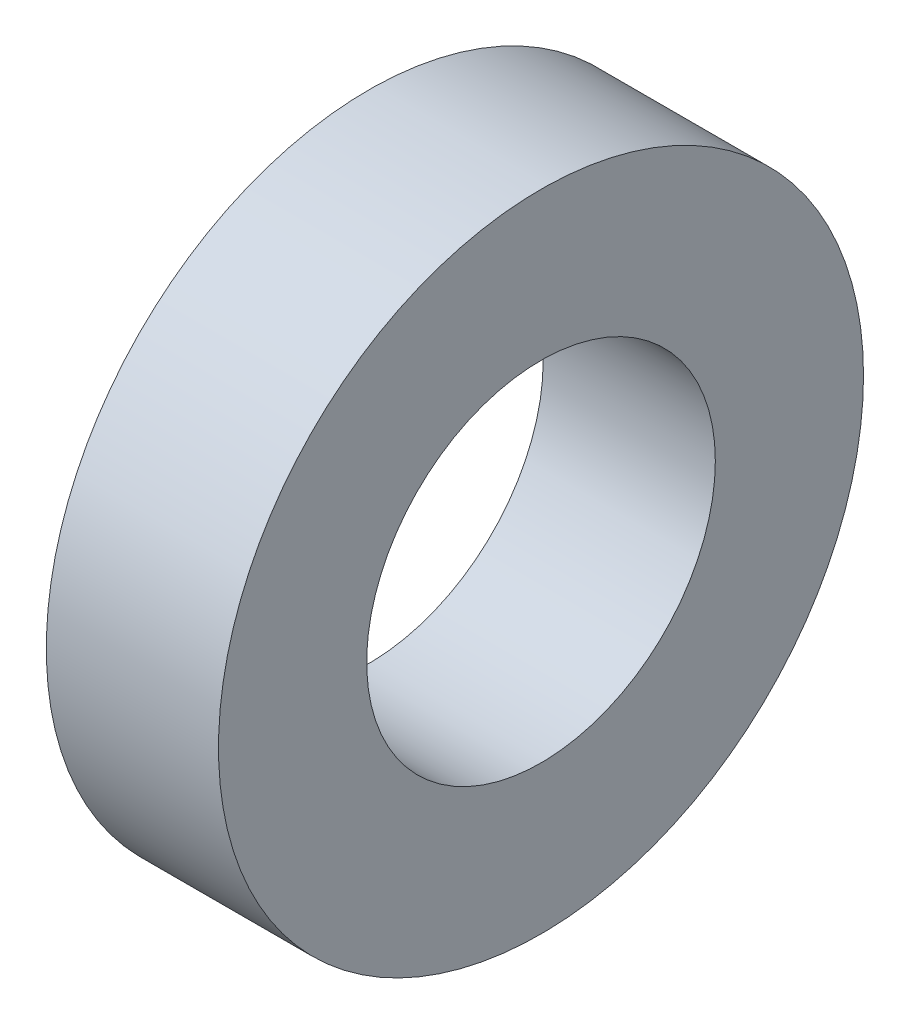
ISO-10303-21;
HEADER;
FILE_DESCRIPTION(('STEP AP214'),'2;1');
FILE_NAME('part.step','',(''),(''),'','','');
FILE_SCHEMA(('AUTOMOTIVE_DESIGN { 1 0 10303 214 1 1 1 1 }'));
ENDSEC;
DATA;
#1=APPLICATION_CONTEXT('core data for automotive mechanical design processes');
#2=APPLICATION_PROTOCOL_DEFINITION('international standard','automotive_design',2000,#1);
#3=PRODUCT_CONTEXT('',#1,'mechanical');
#4=PRODUCT('Part','Part','',(#3));
#5=PRODUCT_RELATED_PRODUCT_CATEGORY('part','',(#4));
#6=PRODUCT_DEFINITION_FORMATION('','',#4);
#7=PRODUCT_DEFINITION_CONTEXT('part definition',#1,'design');
#8=PRODUCT_DEFINITION('design','',#6,#7);
#9=PRODUCT_DEFINITION_SHAPE('','',#8);
#10=(LENGTH_UNIT() NAMED_UNIT(*) SI_UNIT(.MILLI.,.METRE.));
#11=(NAMED_UNIT(*) PLANE_ANGLE_UNIT() SI_UNIT($,.RADIAN.));
#12=(NAMED_UNIT(*) SI_UNIT($,.STERADIAN.) SOLID_ANGLE_UNIT());
#13=UNCERTAINTY_MEASURE_WITH_UNIT(LENGTH_MEASURE(1.E-05),#10,'distance_accuracy_value','');
#14=(GEOMETRIC_REPRESENTATION_CONTEXT(3) GLOBAL_UNCERTAINTY_ASSIGNED_CONTEXT((#13)) GLOBAL_UNIT_ASSIGNED_CONTEXT((#10,
#11,#12)) REPRESENTATION_CONTEXT('',''));
#15=CARTESIAN_POINT('',(0.,0.,0.));
#16=DIRECTION('',(0.,0.,1.));
#17=DIRECTION('',(1.,0.,0.));
#18=AXIS2_PLACEMENT_3D('',#15,#16,#17);
#19=CARTESIAN_POINT('',(7.84,0.,0.));
#20=DIRECTION('',(1.,0.,0.));
#21=DIRECTION('',(0.,0.,-1.));
#22=AXIS2_PLACEMENT_3D('',#19,#20,#21);
#23=PLANE('',#22);
#24=CARTESIAN_POINT('',(7.84,0.,0.));
#25=DIRECTION('',(1.,0.,0.));
#26=DIRECTION('',(0.,0.,-1.));
#27=AXIS2_PLACEMENT_3D('',#24,#25,#26);
#28=CIRCLE('',#27,29.36875);
#29=CARTESIAN_POINT('',(7.84,0.,-29.36875));
#30=VERTEX_POINT('',#29);
#31=EDGE_CURVE('E10',#30,#30,#28,.T.);
#32=ORIENTED_EDGE('',*,*,#31,.T.);
#33=EDGE_LOOP('',(#32));
#34=FACE_BOUND('',#33,.T.);
#35=CARTESIAN_POINT('',(7.84,0.,0.));
#36=DIRECTION('',(1.,0.,0.));
#37=DIRECTION('',(0.,0.,-1.));
#38=AXIS2_PLACEMENT_3D('',#35,#36,#37);
#39=CIRCLE('',#38,15.875);
#40=CARTESIAN_POINT('',(7.84,0.,-15.875));
#41=VERTEX_POINT('',#40);
#42=EDGE_CURVE('E52',#41,#41,#39,.T.);
#43=ORIENTED_EDGE('',*,*,#42,.F.);
#44=EDGE_LOOP('',(#43));
#45=FACE_BOUND('',#44,.T.);
#46=ADVANCED_FACE('F41',(#34,#45),#23,.T.);
#47=CARTESIAN_POINT('',(-7.84,0.,0.));
#48=DIRECTION('',(1.,0.,0.));
#49=DIRECTION('',(0.,0.,-1.));
#50=AXIS2_PLACEMENT_3D('',#47,#48,#49);
#51=PLANE('',#50);
#52=CARTESIAN_POINT('',(-7.84,0.,0.));
#53=DIRECTION('',(1.,0.,0.));
#54=DIRECTION('',(0.,0.,-1.));
#55=AXIS2_PLACEMENT_3D('',#52,#53,#54);
#56=CIRCLE('',#55,29.36875);
#57=CARTESIAN_POINT('',(-7.84,0.,-29.36875));
#58=VERTEX_POINT('',#57);
#59=EDGE_CURVE('E45',#58,#58,#56,.T.);
#60=ORIENTED_EDGE('',*,*,#59,.F.);
#61=EDGE_LOOP('',(#60));
#62=FACE_BOUND('',#61,.T.);
#63=CARTESIAN_POINT('',(-7.84,0.,0.));
#64=DIRECTION('',(1.,0.,0.));
#65=DIRECTION('',(0.,0.,-1.));
#66=AXIS2_PLACEMENT_3D('',#63,#64,#65);
#67=CIRCLE('',#66,15.875);
#68=CARTESIAN_POINT('',(-7.84,0.,-15.875));
#69=VERTEX_POINT('',#68);
#70=EDGE_CURVE('E54',#69,#69,#67,.T.);
#71=ORIENTED_EDGE('',*,*,#70,.T.);
#72=EDGE_LOOP('',(#71));
#73=FACE_BOUND('',#72,.T.);
#74=ADVANCED_FACE('F64',(#62,#73),#51,.F.);
#75=CARTESIAN_POINT('',(7.84,0.,0.));
#76=DIRECTION('',(-1.,0.,0.));
#77=DIRECTION('',(0.,0.,1.));
#78=AXIS2_PLACEMENT_3D('',#75,#76,#77);
#79=CYLINDRICAL_SURFACE('',#78,29.36875);
#80=ORIENTED_EDGE('',*,*,#31,.F.);
#81=EDGE_LOOP('',(#80));
#82=FACE_BOUND('',#81,.T.);
#83=ORIENTED_EDGE('',*,*,#59,.T.);
#84=EDGE_LOOP('',(#83));
#85=FACE_BOUND('',#84,.T.);
#86=ADVANCED_FACE('F43',(#82,#85),#79,.T.);
#87=CARTESIAN_POINT('',(7.84,0.,0.));
#88=DIRECTION('',(-1.,0.,0.));
#89=DIRECTION('',(0.,0.,1.));
#90=AXIS2_PLACEMENT_3D('',#87,#88,#89);
#91=CYLINDRICAL_SURFACE('',#90,15.875);
#92=ORIENTED_EDGE('',*,*,#42,.T.);
#93=EDGE_LOOP('',(#92));
#94=FACE_BOUND('',#93,.T.);
#95=ORIENTED_EDGE('',*,*,#70,.F.);
#96=EDGE_LOOP('',(#95));
#97=FACE_BOUND('',#96,.T.);
#98=ADVANCED_FACE('F60',(#94,#97),#91,.F.);
#99=CLOSED_SHELL('',(#46,#74,#86,#98));
#100=MANIFOLD_SOLID_BREP('B2',#99);
#101=ADVANCED_BREP_SHAPE_REPRESENTATION('',(#18,#100),#14);
#102=SHAPE_DEFINITION_REPRESENTATION(#9,#101);
ENDSEC;
END-ISO-10303-21;
